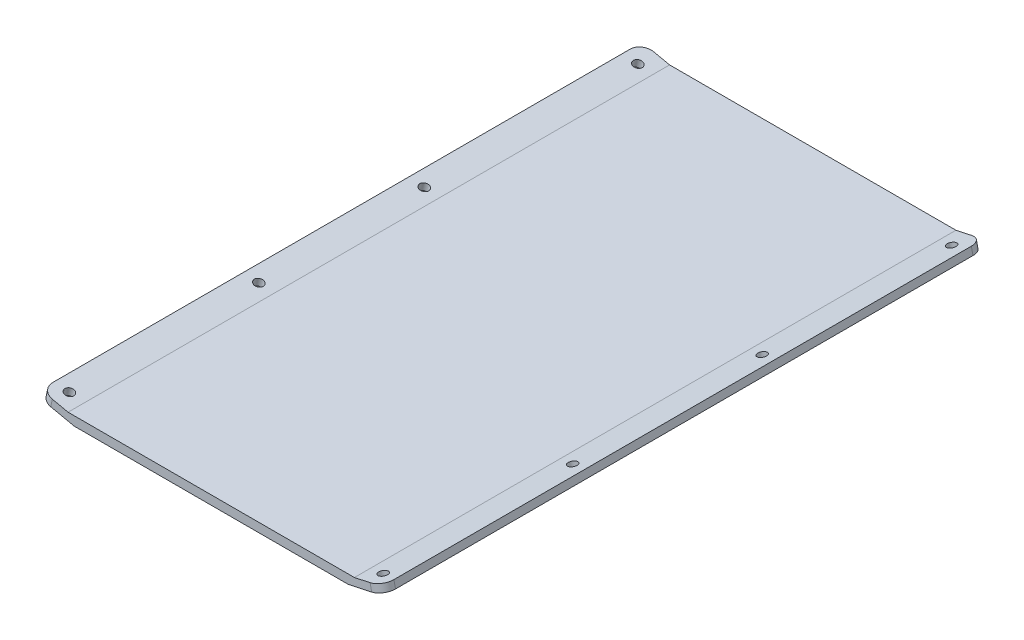
ISO-10303-21;
HEADER;
FILE_DESCRIPTION(('STEP AP214'),'2;1');
FILE_NAME('part.step','',(''),(''),'','','');
FILE_SCHEMA(('AUTOMOTIVE_DESIGN { 1 0 10303 214 1 1 1 1 }'));
ENDSEC;
DATA;
#1=APPLICATION_CONTEXT('core data for automotive mechanical design processes');
#2=APPLICATION_PROTOCOL_DEFINITION('international standard','automotive_design',2000,#1);
#3=PRODUCT_CONTEXT('',#1,'mechanical');
#4=PRODUCT('Part','Part','',(#3));
#5=PRODUCT_RELATED_PRODUCT_CATEGORY('part','',(#4));
#6=PRODUCT_DEFINITION_FORMATION('','',#4);
#7=PRODUCT_DEFINITION_CONTEXT('part definition',#1,'design');
#8=PRODUCT_DEFINITION('design','',#6,#7);
#9=PRODUCT_DEFINITION_SHAPE('','',#8);
#10=(LENGTH_UNIT() NAMED_UNIT(*) SI_UNIT(.MILLI.,.METRE.));
#11=(NAMED_UNIT(*) PLANE_ANGLE_UNIT() SI_UNIT($,.RADIAN.));
#12=(NAMED_UNIT(*) SI_UNIT($,.STERADIAN.) SOLID_ANGLE_UNIT());
#13=UNCERTAINTY_MEASURE_WITH_UNIT(LENGTH_MEASURE(1.E-05),#10,'distance_accuracy_value','');
#14=(GEOMETRIC_REPRESENTATION_CONTEXT(3) GLOBAL_UNCERTAINTY_ASSIGNED_CONTEXT((#13)) GLOBAL_UNIT_ASSIGNED_CONTEXT((#10,
#11,#12)) REPRESENTATION_CONTEXT('',''));
#15=CARTESIAN_POINT('',(0.,0.,0.));
#16=DIRECTION('',(0.,0.,1.));
#17=DIRECTION('',(1.,0.,0.));
#18=AXIS2_PLACEMENT_3D('',#15,#16,#17);
#19=CARTESIAN_POINT('',(149.808156351038,-308.786682776371,209.55));
#20=DIRECTION('',(-0.211002067247362,0.977485615043689,0.));
#21=DIRECTION('',(-0.977485615043689,-0.211002067247362,0.));
#22=AXIS2_PLACEMENT_3D('',#19,#20,#21);
#23=CYLINDRICAL_SURFACE('',#22,2.38125000000007);
#24=CARTESIAN_POINT('',(82.815,1.565,209.55));
#25=DIRECTION('',(-0.211002067247362,0.977485615043689,0.));
#26=DIRECTION('',(-0.977485615043689,-0.211002067247362,0.));
#27=AXIS2_PLACEMENT_3D('',#24,#25,#26);
#28=CIRCLE('',#27,2.38125000000007);
#29=CARTESIAN_POINT('',(80.4873623791772,1.06255132736721,209.55));
#30=VERTEX_POINT('',#29);
#31=EDGE_CURVE('E48',#30,#30,#28,.T.);
#32=ORIENTED_EDGE('',*,*,#31,.T.);
#33=EDGE_LOOP('',(#32));
#34=FACE_BOUND('',#33,.T.);
#35=CARTESIAN_POINT('',(83.6543574892444,-2.32339731439074,209.55));
#36=DIRECTION('',(-0.211002067247362,0.977485615043689,0.));
#37=DIRECTION('',(-0.977485615043689,-0.211002067247362,0.));
#38=AXIS2_PLACEMENT_3D('',#35,#36,#37);
#39=CIRCLE('',#38,2.38125000000007);
#40=CARTESIAN_POINT('',(81.3267198684215,-2.82584598702354,209.55));
#41=VERTEX_POINT('',#40);
#42=EDGE_CURVE('E11',#41,#41,#39,.T.);
#43=ORIENTED_EDGE('',*,*,#42,.F.);
#44=EDGE_LOOP('',(#43));
#45=FACE_BOUND('',#44,.T.);
#46=ADVANCED_FACE('F41',(#34,#45),#23,.F.);
#47=CARTESIAN_POINT('',(-75.565,0.,317.5));
#48=DIRECTION('',(-0.211002067247362,-0.977485615043689,0.));
#49=DIRECTION('',(0.977485615043689,-0.211002067247362,0.));
#50=AXIS2_PLACEMENT_3D('',#47,#48,#49);
#51=PLANE('',#50);
#52=CARTESIAN_POINT('',(-82.815,1.56499999999998,9.525));
#53=DIRECTION('',(0.211002067247362,0.977485615043689,0.));
#54=DIRECTION('',(-0.977485615043689,0.211002067247362,0.));
#55=AXIS2_PLACEMENT_3D('',#52,#53,#54);
#56=CIRCLE('',#55,2.38125000000001);
#57=CARTESIAN_POINT('',(-85.1426376208228,2.06744867263276,9.525));
#58=VERTEX_POINT('',#57);
#59=EDGE_CURVE('E232',#58,#58,#56,.T.);
#60=ORIENTED_EDGE('',*,*,#59,.F.);
#61=EDGE_LOOP('',(#60));
#62=FACE_BOUND('',#61,.T.);
#63=CARTESIAN_POINT('',(-82.815,1.56499999999998,122.2375));
#64=DIRECTION('',(0.211002067247362,0.977485615043689,0.));
#65=DIRECTION('',(-0.977485615043689,0.211002067247362,0.));
#66=AXIS2_PLACEMENT_3D('',#63,#64,#65);
#67=CIRCLE('',#66,2.38125000000001);
#68=CARTESIAN_POINT('',(-85.1426376208228,2.06744867263276,122.2375));
#69=VERTEX_POINT('',#68);
#70=EDGE_CURVE('E314',#69,#69,#67,.T.);
#71=ORIENTED_EDGE('',*,*,#70,.F.);
#72=EDGE_LOOP('',(#71));
#73=FACE_BOUND('',#72,.T.);
#74=CARTESIAN_POINT('',(-82.815,1.56499999999998,209.55));
#75=DIRECTION('',(0.211002067247362,0.977485615043689,0.));
#76=DIRECTION('',(-0.977485615043689,0.211002067247362,0.));
#77=AXIS2_PLACEMENT_3D('',#74,#75,#76);
#78=CIRCLE('',#77,2.38125000000001);
#79=CARTESIAN_POINT('',(-85.1426376208228,2.06744867263276,209.55));
#80=VERTEX_POINT('',#79);
#81=EDGE_CURVE('E310',#80,#80,#78,.T.);
#82=ORIENTED_EDGE('',*,*,#81,.F.);
#83=EDGE_LOOP('',(#82));
#84=FACE_BOUND('',#83,.T.);
#85=CARTESIAN_POINT('',(-82.815,1.56499999999998,309.5625));
#86=DIRECTION('',(0.211002067247362,0.977485615043689,0.));
#87=DIRECTION('',(-0.977485615043689,0.211002067247362,0.));
#88=AXIS2_PLACEMENT_3D('',#85,#86,#87);
#89=CIRCLE('',#88,2.38125000000008);
#90=CARTESIAN_POINT('',(-85.1426376208229,2.06744867263278,309.5625));
#91=VERTEX_POINT('',#90);
#92=EDGE_CURVE('E307',#91,#91,#89,.T.);
#93=ORIENTED_EDGE('',*,*,#92,.F.);
#94=EDGE_LOOP('',(#93));
#95=FACE_BOUND('',#94,.T.);
#96=DIRECTION('',(-0.977485615043689,0.211002067247362,0.));
#97=VECTOR('',#96,1.);
#98=CARTESIAN_POINT('',(-75.565,0.,0.));
#99=LINE('',#98,#97);
#100=CARTESIAN_POINT('',(-75.565,0.,0.));
#101=VERTEX_POINT('',#100);
#102=CARTESIAN_POINT('',(-83.8579663444726,1.79013687297923,0.));
#103=VERTEX_POINT('',#102);
#104=EDGE_CURVE('E167',#101,#103,#99,.T.);
#105=ORIENTED_EDGE('',*,*,#104,.T.);
#106=CARTESIAN_POINT('',(-83.8579663444726,1.79013687297923,6.35000000000002));
#107=DIRECTION('',(-0.211002067247362,-0.977485615043689,0.));
#108=DIRECTION('',(0.977485615043689,-0.211002067247362,0.));
#109=AXIS2_PLACEMENT_3D('',#106,#107,#108);
#110=CIRCLE('',#109,6.35);
#111=CARTESIAN_POINT('',(-90.065,3.12999999999998,6.35000000000013));
#112=VERTEX_POINT('',#111);
#113=EDGE_CURVE('E212',#103,#112,#110,.F.);
#114=ORIENTED_EDGE('',*,*,#113,.T.);
#115=DIRECTION('',(0.,0.,-1.));
#116=VECTOR('',#115,1.);
#117=CARTESIAN_POINT('',(-90.065,3.12999999999998,317.5));
#118=LINE('',#117,#116);
#119=CARTESIAN_POINT('',(-90.065,3.12999999999998,311.15));
#120=VERTEX_POINT('',#119);
#121=EDGE_CURVE('E194',#120,#112,#118,.T.);
#122=ORIENTED_EDGE('',*,*,#121,.F.);
#123=CARTESIAN_POINT('',(-83.8579663444726,1.79013687297923,311.15));
#124=DIRECTION('',(-0.211002067247362,-0.977485615043689,0.));
#125=DIRECTION('',(0.977485615043689,-0.211002067247362,0.));
#126=AXIS2_PLACEMENT_3D('',#123,#124,#125);
#127=CIRCLE('',#126,6.35);
#128=CARTESIAN_POINT('',(-83.8579663444726,1.79013687297923,317.5));
#129=VERTEX_POINT('',#128);
#130=EDGE_CURVE('E210',#120,#129,#127,.F.);
#131=ORIENTED_EDGE('',*,*,#130,.T.);
#132=DIRECTION('',(-0.977485615043689,0.211002067247362,0.));
#133=VECTOR('',#132,1.);
#134=CARTESIAN_POINT('',(-75.565,0.,317.5));
#135=LINE('',#134,#133);
#136=CARTESIAN_POINT('',(-75.565,0.,317.5));
#137=VERTEX_POINT('',#136);
#138=EDGE_CURVE('E142',#137,#129,#135,.T.);
#139=ORIENTED_EDGE('',*,*,#138,.F.);
#140=DIRECTION('',(0.,0.,-1.));
#141=VECTOR('',#140,1.);
#142=CARTESIAN_POINT('',(-75.565,0.,317.5));
#143=LINE('',#142,#141);
#144=EDGE_CURVE('E166',#137,#101,#143,.T.);
#145=ORIENTED_EDGE('',*,*,#144,.T.);
#146=EDGE_LOOP('',(#105,#114,#122,#131,#139,#145));
#147=FACE_BOUND('',#146,.T.);
#148=ADVANCED_FACE('F262',(#62,#73,#84,#95,#147),#51,.F.);
#149=CARTESIAN_POINT('',(-90.065,3.12999999999998,317.5));
#150=DIRECTION('',(0.977485615043689,-0.211002067247362,0.));
#151=DIRECTION('',(0.211002067247362,0.977485615043689,0.));
#152=AXIS2_PLACEMENT_3D('',#149,#150,#151);
#153=PLANE('',#152);
#154=ORIENTED_EDGE('',*,*,#121,.T.);
#155=DIRECTION('',(-0.211002067247362,-0.977485615043689,0.));
#156=VECTOR('',#155,1.);
#157=CARTESIAN_POINT('',(-90.065,3.12999999999998,6.35000000000002));
#158=LINE('',#157,#156);
#159=CARTESIAN_POINT('',(-90.9043574892443,-0.758397314390727,6.35000000000013));
#160=VERTEX_POINT('',#159);
#161=EDGE_CURVE('E199',#112,#160,#158,.T.);
#162=ORIENTED_EDGE('',*,*,#161,.T.);
#163=DIRECTION('',(0.,0.,-1.));
#164=VECTOR('',#163,1.);
#165=CARTESIAN_POINT('',(-90.9043574892443,-0.758397314390727,317.5));
#166=LINE('',#165,#164);
#167=CARTESIAN_POINT('',(-90.9043574892443,-0.758397314390727,311.15));
#168=VERTEX_POINT('',#167);
#169=EDGE_CURVE('E152',#168,#160,#166,.T.);
#170=ORIENTED_EDGE('',*,*,#169,.F.);
#171=DIRECTION('',(-0.211002067247362,-0.977485615043689,0.));
#172=VECTOR('',#171,1.);
#173=CARTESIAN_POINT('',(-90.065,3.12999999999998,311.15));
#174=LINE('',#173,#172);
#175=EDGE_CURVE('E197',#168,#120,#174,.F.);
#176=ORIENTED_EDGE('',*,*,#175,.T.);
#177=EDGE_LOOP('',(#154,#162,#170,#176));
#178=FACE_BOUND('',#177,.T.);
#179=ADVANCED_FACE('F266',(#178),#153,.F.);
#180=CARTESIAN_POINT('',(-90.9043574892443,-0.758397314390727,317.5));
#181=DIRECTION('',(0.211002067247362,0.977485615043689,0.));
#182=DIRECTION('',(-0.977485615043689,0.211002067247362,0.));
#183=AXIS2_PLACEMENT_3D('',#180,#181,#182);
#184=PLANE('',#183);
#185=CARTESIAN_POINT('',(-83.6543574892443,-2.32339731439074,9.525));
#186=DIRECTION('',(0.211002067247362,0.977485615043689,0.));
#187=DIRECTION('',(-0.977485615043689,0.211002067247362,0.));
#188=AXIS2_PLACEMENT_3D('',#185,#186,#187);
#189=CIRCLE('',#188,2.38125000000001);
#190=CARTESIAN_POINT('',(-85.9819951100671,-1.82094864175796,9.525));
#191=VERTEX_POINT('',#190);
#192=EDGE_CURVE('E170',#191,#191,#189,.T.);
#193=ORIENTED_EDGE('',*,*,#192,.T.);
#194=EDGE_LOOP('',(#193));
#195=FACE_BOUND('',#194,.T.);
#196=CARTESIAN_POINT('',(-83.6543574892443,-2.32339731439074,122.2375));
#197=DIRECTION('',(0.211002067247362,0.977485615043689,0.));
#198=DIRECTION('',(-0.977485615043689,0.211002067247362,0.));
#199=AXIS2_PLACEMENT_3D('',#196,#197,#198);
#200=CIRCLE('',#199,2.38125000000001);
#201=CARTESIAN_POINT('',(-85.9819951100671,-1.82094864175796,122.2375));
#202=VERTEX_POINT('',#201);
#203=EDGE_CURVE('E235',#202,#202,#200,.T.);
#204=ORIENTED_EDGE('',*,*,#203,.T.);
#205=EDGE_LOOP('',(#204));
#206=FACE_BOUND('',#205,.T.);
#207=CARTESIAN_POINT('',(-83.6543574892443,-2.32339731439074,209.55));
#208=DIRECTION('',(0.211002067247362,0.977485615043689,0.));
#209=DIRECTION('',(-0.977485615043689,0.211002067247362,0.));
#210=AXIS2_PLACEMENT_3D('',#207,#208,#209);
#211=CIRCLE('',#210,2.38125000000001);
#212=CARTESIAN_POINT('',(-85.9819951100671,-1.82094864175796,209.55));
#213=VERTEX_POINT('',#212);
#214=EDGE_CURVE('E231',#213,#213,#211,.T.);
#215=ORIENTED_EDGE('',*,*,#214,.T.);
#216=EDGE_LOOP('',(#215));
#217=FACE_BOUND('',#216,.T.);
#218=CARTESIAN_POINT('',(-83.6543574892443,-2.32339731439074,309.5625));
#219=DIRECTION('',(0.211002067247362,0.977485615043689,0.));
#220=DIRECTION('',(-0.977485615043689,0.211002067247362,0.));
#221=AXIS2_PLACEMENT_3D('',#218,#219,#220);
#222=CIRCLE('',#221,2.38125000000008);
#223=CARTESIAN_POINT('',(-85.9819951100672,-1.82094864175794,309.5625));
#224=VERTEX_POINT('',#223);
#225=EDGE_CURVE('E228',#224,#224,#222,.T.);
#226=ORIENTED_EDGE('',*,*,#225,.T.);
#227=EDGE_LOOP('',(#226));
#228=FACE_BOUND('',#227,.T.);
#229=ORIENTED_EDGE('',*,*,#169,.T.);
#230=CARTESIAN_POINT('',(-84.6973238337169,-2.09826044141147,6.35000000000002));
#231=DIRECTION('',(0.211002067247362,0.977485615043689,0.));
#232=DIRECTION('',(-0.977485615043689,0.211002067247362,0.));
#233=AXIS2_PLACEMENT_3D('',#230,#231,#232);
#234=CIRCLE('',#233,6.35);
#235=CARTESIAN_POINT('',(-84.6973238337169,-2.09826044141147,0.));
#236=VERTEX_POINT('',#235);
#237=EDGE_CURVE('E204',#160,#236,#234,.F.);
#238=ORIENTED_EDGE('',*,*,#237,.T.);
#239=DIRECTION('',(0.977485615043689,-0.211002067247362,0.));
#240=VECTOR('',#239,1.);
#241=CARTESIAN_POINT('',(-90.9043574892443,-0.758397314390727,0.));
#242=LINE('',#241,#240);
#243=CARTESIAN_POINT('',(-72.355,-4.76250000000002,0.));
#244=VERTEX_POINT('',#243);
#245=EDGE_CURVE('E149',#236,#244,#242,.T.);
#246=ORIENTED_EDGE('',*,*,#245,.T.);
#247=DIRECTION('',(0.,0.,-1.));
#248=VECTOR('',#247,1.);
#249=CARTESIAN_POINT('',(-72.355,-4.76250000000002,317.5));
#250=LINE('',#249,#248);
#251=CARTESIAN_POINT('',(-72.355,-4.76250000000002,317.5));
#252=VERTEX_POINT('',#251);
#253=EDGE_CURVE('E145',#252,#244,#250,.T.);
#254=ORIENTED_EDGE('',*,*,#253,.F.);
#255=DIRECTION('',(0.977485615043689,-0.211002067247362,0.));
#256=VECTOR('',#255,1.);
#257=CARTESIAN_POINT('',(-90.9043574892443,-0.758397314390727,317.5));
#258=LINE('',#257,#256);
#259=CARTESIAN_POINT('',(-84.6973238337169,-2.09826044141147,317.5));
#260=VERTEX_POINT('',#259);
#261=EDGE_CURVE('E132',#260,#252,#258,.T.);
#262=ORIENTED_EDGE('',*,*,#261,.F.);
#263=CARTESIAN_POINT('',(-84.6973238337169,-2.09826044141147,311.15));
#264=DIRECTION('',(0.211002067247362,0.977485615043689,0.));
#265=DIRECTION('',(-0.977485615043689,0.211002067247362,0.));
#266=AXIS2_PLACEMENT_3D('',#263,#264,#265);
#267=CIRCLE('',#266,6.35);
#268=EDGE_CURVE('E202',#260,#168,#267,.F.);
#269=ORIENTED_EDGE('',*,*,#268,.T.);
#270=EDGE_LOOP('',(#229,#238,#246,#254,#262,#269));
#271=FACE_BOUND('',#270,.T.);
#272=ADVANCED_FACE('F147',(#195,#206,#217,#228,#271),#184,.F.);
#273=CARTESIAN_POINT('',(-72.355,-4.76250000000002,317.5));
#274=DIRECTION('',(0.,1.,0.));
#275=DIRECTION('',(-1.,0.,0.));
#276=AXIS2_PLACEMENT_3D('',#273,#274,#275);
#277=PLANE('',#276);
#278=DIRECTION('',(1.,0.,0.));
#279=VECTOR('',#278,1.);
#280=CARTESIAN_POINT('',(-72.355,-4.76250000000002,0.));
#281=LINE('',#280,#279);
#282=CARTESIAN_POINT('',(72.355,-4.7625,0.));
#283=VERTEX_POINT('',#282);
#284=EDGE_CURVE('E172',#244,#283,#281,.T.);
#285=ORIENTED_EDGE('',*,*,#284,.T.);
#286=DIRECTION('',(0.,0.,-1.));
#287=VECTOR('',#286,1.);
#288=CARTESIAN_POINT('',(72.355,-4.7625,317.5));
#289=LINE('',#288,#287);
#290=CARTESIAN_POINT('',(72.355,-4.7625,317.5));
#291=VERTEX_POINT('',#290);
#292=EDGE_CURVE('E153',#291,#283,#289,.T.);
#293=ORIENTED_EDGE('',*,*,#292,.F.);
#294=DIRECTION('',(1.,0.,0.));
#295=VECTOR('',#294,1.);
#296=CARTESIAN_POINT('',(-72.355,-4.76250000000002,317.5));
#297=LINE('',#296,#295);
#298=EDGE_CURVE('E136',#252,#291,#297,.T.);
#299=ORIENTED_EDGE('',*,*,#298,.F.);
#300=ORIENTED_EDGE('',*,*,#253,.T.);
#301=EDGE_LOOP('',(#285,#293,#299,#300));
#302=FACE_BOUND('',#301,.T.);
#303=ADVANCED_FACE('F155',(#302),#277,.F.);
#304=CARTESIAN_POINT('',(90.9043574892443,-0.7583973143907,317.5));
#305=DIRECTION('',(-0.211002067247362,0.977485615043689,0.));
#306=DIRECTION('',(-0.977485615043689,-0.211002067247362,0.));
#307=AXIS2_PLACEMENT_3D('',#304,#305,#306);
#308=PLANE('',#307);
#309=CARTESIAN_POINT('',(83.6543574892444,-2.32339731439074,309.5625));
#310=DIRECTION('',(-0.211002067247362,0.977485615043689,0.));
#311=DIRECTION('',(-0.977485615043689,-0.211002067247362,0.));
#312=AXIS2_PLACEMENT_3D('',#309,#310,#311);
#313=CIRCLE('',#312,2.38125000000007);
#314=CARTESIAN_POINT('',(81.3267198684215,-2.82584598702354,309.5625));
#315=VERTEX_POINT('',#314);
#316=EDGE_CURVE('E330',#315,#315,#313,.T.);
#317=ORIENTED_EDGE('',*,*,#316,.T.);
#318=EDGE_LOOP('',(#317));
#319=FACE_BOUND('',#318,.T.);
#320=CARTESIAN_POINT('',(83.6543574892444,-2.32339731439074,109.5375));
#321=DIRECTION('',(-0.211002067247362,0.977485615043689,0.));
#322=DIRECTION('',(-0.977485615043689,-0.211002067247362,0.));
#323=AXIS2_PLACEMENT_3D('',#320,#321,#322);
#324=CIRCLE('',#323,2.38125000000007);
#325=CARTESIAN_POINT('',(81.3267198684215,-2.82584598702354,109.5375));
#326=VERTEX_POINT('',#325);
#327=EDGE_CURVE('E324',#326,#326,#324,.T.);
#328=ORIENTED_EDGE('',*,*,#327,.T.);
#329=EDGE_LOOP('',(#328));
#330=FACE_BOUND('',#329,.T.);
#331=CARTESIAN_POINT('',(83.6543574892444,-2.32339731439074,9.525));
#332=DIRECTION('',(-0.211002067247362,0.977485615043689,0.));
#333=DIRECTION('',(-0.977485615043689,-0.211002067247362,0.));
#334=AXIS2_PLACEMENT_3D('',#331,#332,#333);
#335=CIRCLE('',#334,2.38125000000007);
#336=CARTESIAN_POINT('',(81.3267198684215,-2.82584598702354,9.525));
#337=VERTEX_POINT('',#336);
#338=EDGE_CURVE('E311',#337,#337,#335,.T.);
#339=ORIENTED_EDGE('',*,*,#338,.T.);
#340=EDGE_LOOP('',(#339));
#341=FACE_BOUND('',#340,.T.);
#342=DIRECTION('',(0.977485615043689,0.211002067247362,0.));
#343=VECTOR('',#342,1.);
#344=CARTESIAN_POINT('',(90.9043574892443,-0.7583973143907,0.));
#345=LINE('',#344,#343);
#346=CARTESIAN_POINT('',(84.6973238337169,-2.09826044141145,0.));
#347=VERTEX_POINT('',#346);
#348=EDGE_CURVE('E174',#283,#347,#345,.T.);
#349=ORIENTED_EDGE('',*,*,#348,.T.);
#350=CARTESIAN_POINT('',(84.6973238337169,-2.09826044141145,6.35000000000002));
#351=DIRECTION('',(-0.211002067247362,0.977485615043689,0.));
#352=DIRECTION('',(-0.977485615043689,-0.211002067247362,0.));
#353=AXIS2_PLACEMENT_3D('',#350,#351,#352);
#354=CIRCLE('',#353,6.35);
#355=CARTESIAN_POINT('',(90.9043574892443,-0.7583973143907,6.35000000000013));
#356=VERTEX_POINT('',#355);
#357=EDGE_CURVE('E223',#347,#356,#354,.F.);
#358=ORIENTED_EDGE('',*,*,#357,.T.);
#359=DIRECTION('',(0.,0.,-1.));
#360=VECTOR('',#359,1.);
#361=CARTESIAN_POINT('',(90.9043574892443,-0.7583973143907,317.5));
#362=LINE('',#361,#360);
#363=CARTESIAN_POINT('',(90.9043574892443,-0.7583973143907,311.15));
#364=VERTEX_POINT('',#363);
#365=EDGE_CURVE('E189',#364,#356,#362,.T.);
#366=ORIENTED_EDGE('',*,*,#365,.F.);
#367=CARTESIAN_POINT('',(84.6973238337169,-2.09826044141145,311.15));
#368=DIRECTION('',(-0.211002067247362,0.977485615043689,0.));
#369=DIRECTION('',(-0.977485615043689,-0.211002067247362,0.));
#370=AXIS2_PLACEMENT_3D('',#367,#368,#369);
#371=CIRCLE('',#370,6.35);
#372=CARTESIAN_POINT('',(84.6973238337169,-2.09826044141145,317.5));
#373=VERTEX_POINT('',#372);
#374=EDGE_CURVE('E55',#364,#373,#371,.F.);
#375=ORIENTED_EDGE('',*,*,#374,.T.);
#376=DIRECTION('',(0.977485615043689,0.211002067247362,0.));
#377=VECTOR('',#376,1.);
#378=CARTESIAN_POINT('',(90.9043574892443,-0.7583973143907,317.5));
#379=LINE('',#378,#377);
#380=EDGE_CURVE('E157',#291,#373,#379,.T.);
#381=ORIENTED_EDGE('',*,*,#380,.F.);
#382=ORIENTED_EDGE('',*,*,#292,.T.);
#383=EDGE_LOOP('',(#349,#358,#366,#375,#381,#382));
#384=FACE_BOUND('',#383,.T.);
#385=ORIENTED_EDGE('',*,*,#42,.T.);
#386=EDGE_LOOP('',(#385));
#387=FACE_BOUND('',#386,.T.);
#388=ADVANCED_FACE('F256',(#319,#330,#341,#384,#387),#308,.F.);
#389=CARTESIAN_POINT('',(90.065,3.13,317.5));
#390=DIRECTION('',(-0.977485615043689,-0.211002067247365,0.));
#391=DIRECTION('',(0.211002067247365,-0.977485615043689,0.));
#392=AXIS2_PLACEMENT_3D('',#389,#390,#391);
#393=PLANE('',#392);
#394=ORIENTED_EDGE('',*,*,#365,.T.);
#395=DIRECTION('',(-0.211002067247365,0.977485615043689,0.));
#396=VECTOR('',#395,1.);
#397=CARTESIAN_POINT('',(90.065,3.13,6.35000000000002));
#398=LINE('',#397,#396);
#399=CARTESIAN_POINT('',(90.065,3.13,6.35000000000013));
#400=VERTEX_POINT('',#399);
#401=EDGE_CURVE('E216',#356,#400,#398,.T.);
#402=ORIENTED_EDGE('',*,*,#401,.T.);
#403=DIRECTION('',(0.,0.,-1.));
#404=VECTOR('',#403,1.);
#405=CARTESIAN_POINT('',(90.065,3.13,317.5));
#406=LINE('',#405,#404);
#407=CARTESIAN_POINT('',(90.065,3.13,311.15));
#408=VERTEX_POINT('',#407);
#409=EDGE_CURVE('E186',#408,#400,#406,.T.);
#410=ORIENTED_EDGE('',*,*,#409,.F.);
#411=DIRECTION('',(-0.211002067247365,0.977485615043689,0.));
#412=VECTOR('',#411,1.);
#413=CARTESIAN_POINT('',(90.9043574892443,-0.758397314390707,311.15));
#414=LINE('',#413,#412);
#415=EDGE_CURVE('E214',#408,#364,#414,.F.);
#416=ORIENTED_EDGE('',*,*,#415,.T.);
#417=EDGE_LOOP('',(#394,#402,#410,#416));
#418=FACE_BOUND('',#417,.T.);
#419=ADVANCED_FACE('F247',(#418),#393,.F.);
#420=CARTESIAN_POINT('',(75.565,0.,317.5));
#421=DIRECTION('',(0.211002067247362,-0.977485615043689,0.));
#422=DIRECTION('',(0.977485615043689,0.211002067247362,0.));
#423=AXIS2_PLACEMENT_3D('',#420,#421,#422);
#424=PLANE('',#423);
#425=CARTESIAN_POINT('',(82.815,1.565,309.5625));
#426=DIRECTION('',(-0.211002067247362,0.977485615043689,0.));
#427=DIRECTION('',(-0.977485615043689,-0.211002067247362,0.));
#428=AXIS2_PLACEMENT_3D('',#425,#426,#427);
#429=CIRCLE('',#428,2.38125000000007);
#430=CARTESIAN_POINT('',(80.4873623791772,1.06255132736721,309.5625));
#431=VERTEX_POINT('',#430);
#432=EDGE_CURVE('E333',#431,#431,#429,.T.);
#433=ORIENTED_EDGE('',*,*,#432,.F.);
#434=EDGE_LOOP('',(#433));
#435=FACE_BOUND('',#434,.T.);
#436=CARTESIAN_POINT('',(82.815,1.565,109.5375));
#437=DIRECTION('',(-0.211002067247362,0.977485615043689,0.));
#438=DIRECTION('',(-0.977485615043689,-0.211002067247362,0.));
#439=AXIS2_PLACEMENT_3D('',#436,#437,#438);
#440=CIRCLE('',#439,2.38125000000007);
#441=CARTESIAN_POINT('',(80.4873623791772,1.06255132736721,109.5375));
#442=VERTEX_POINT('',#441);
#443=EDGE_CURVE('E327',#442,#442,#440,.T.);
#444=ORIENTED_EDGE('',*,*,#443,.F.);
#445=EDGE_LOOP('',(#444));
#446=FACE_BOUND('',#445,.T.);
#447=CARTESIAN_POINT('',(82.815,1.565,9.525));
#448=DIRECTION('',(-0.211002067247362,0.977485615043689,0.));
#449=DIRECTION('',(-0.977485615043689,-0.211002067247362,0.));
#450=AXIS2_PLACEMENT_3D('',#447,#448,#449);
#451=CIRCLE('',#450,2.38125000000007);
#452=CARTESIAN_POINT('',(80.4873623791772,1.06255132736721,9.525));
#453=VERTEX_POINT('',#452);
#454=EDGE_CURVE('E321',#453,#453,#451,.T.);
#455=ORIENTED_EDGE('',*,*,#454,.F.);
#456=EDGE_LOOP('',(#455));
#457=FACE_BOUND('',#456,.T.);
#458=ORIENTED_EDGE('',*,*,#409,.T.);
#459=CARTESIAN_POINT('',(83.8579663444726,1.79013687297925,6.35000000000002));
#460=DIRECTION('',(0.211002067247362,-0.977485615043689,0.));
#461=DIRECTION('',(0.977485615043689,0.211002067247362,0.));
#462=AXIS2_PLACEMENT_3D('',#459,#460,#461);
#463=CIRCLE('',#462,6.35);
#464=CARTESIAN_POINT('',(83.8579663444726,1.79013687297925,0.));
#465=VERTEX_POINT('',#464);
#466=EDGE_CURVE('E220',#400,#465,#463,.F.);
#467=ORIENTED_EDGE('',*,*,#466,.T.);
#468=DIRECTION('',(-0.977485615043689,-0.211002067247362,0.));
#469=VECTOR('',#468,1.);
#470=CARTESIAN_POINT('',(75.565,0.,0.));
#471=LINE('',#470,#469);
#472=CARTESIAN_POINT('',(75.565,0.,0.));
#473=VERTEX_POINT('',#472);
#474=EDGE_CURVE('E177',#465,#473,#471,.T.);
#475=ORIENTED_EDGE('',*,*,#474,.T.);
#476=DIRECTION('',(0.,0.,-1.));
#477=VECTOR('',#476,1.);
#478=CARTESIAN_POINT('',(75.565,0.,317.5));
#479=LINE('',#478,#477);
#480=CARTESIAN_POINT('',(75.565,0.,317.5));
#481=VERTEX_POINT('',#480);
#482=EDGE_CURVE('E183',#481,#473,#479,.T.);
#483=ORIENTED_EDGE('',*,*,#482,.F.);
#484=DIRECTION('',(-0.977485615043689,-0.211002067247362,0.));
#485=VECTOR('',#484,1.);
#486=CARTESIAN_POINT('',(75.565,0.,317.5));
#487=LINE('',#486,#485);
#488=CARTESIAN_POINT('',(83.8579663444726,1.79013687297925,317.5));
#489=VERTEX_POINT('',#488);
#490=EDGE_CURVE('E159',#489,#481,#487,.T.);
#491=ORIENTED_EDGE('',*,*,#490,.F.);
#492=CARTESIAN_POINT('',(83.8579663444726,1.79013687297925,311.15));
#493=DIRECTION('',(0.211002067247362,-0.977485615043689,0.));
#494=DIRECTION('',(0.977485615043689,0.211002067247362,0.));
#495=AXIS2_PLACEMENT_3D('',#492,#493,#494);
#496=CIRCLE('',#495,6.35);
#497=EDGE_CURVE('E63',#489,#408,#496,.F.);
#498=ORIENTED_EDGE('',*,*,#497,.T.);
#499=EDGE_LOOP('',(#458,#467,#475,#483,#491,#498));
#500=FACE_BOUND('',#499,.T.);
#501=ORIENTED_EDGE('',*,*,#31,.F.);
#502=EDGE_LOOP('',(#501));
#503=FACE_BOUND('',#502,.T.);
#504=ADVANCED_FACE('F244',(#435,#446,#457,#500,#503),#424,.F.);
#505=CARTESIAN_POINT('',(75.565,0.,317.5));
#506=DIRECTION('',(0.,-1.,0.));
#507=DIRECTION('',(1.,0.,0.));
#508=AXIS2_PLACEMENT_3D('',#505,#506,#507);
#509=PLANE('',#508);
#510=DIRECTION('',(-1.,0.,0.));
#511=VECTOR('',#510,1.);
#512=CARTESIAN_POINT('',(75.565,0.,0.));
#513=LINE('',#512,#511);
#514=EDGE_CURVE('E179',#473,#101,#513,.T.);
#515=ORIENTED_EDGE('',*,*,#514,.T.);
#516=ORIENTED_EDGE('',*,*,#144,.F.);
#517=DIRECTION('',(-1.,0.,0.));
#518=VECTOR('',#517,1.);
#519=CARTESIAN_POINT('',(75.565,0.,317.5));
#520=LINE('',#519,#518);
#521=EDGE_CURVE('E164',#481,#137,#520,.T.);
#522=ORIENTED_EDGE('',*,*,#521,.F.);
#523=ORIENTED_EDGE('',*,*,#482,.T.);
#524=EDGE_LOOP('',(#515,#516,#522,#523));
#525=FACE_BOUND('',#524,.T.);
#526=ADVANCED_FACE('F246',(#525),#509,.F.);
#527=CARTESIAN_POINT('',(0.,0.,317.5));
#528=DIRECTION('',(0.,0.,1.));
#529=DIRECTION('',(1.,0.,0.));
#530=AXIS2_PLACEMENT_3D('',#527,#528,#529);
#531=PLANE('',#530);
#532=ORIENTED_EDGE('',*,*,#380,.T.);
#533=DIRECTION('',(-0.211002067247365,0.977485615043689,0.));
#534=VECTOR('',#533,1.);
#535=CARTESIAN_POINT('',(83.8579663444726,1.79013687297923,317.5));
#536=LINE('',#535,#534);
#537=EDGE_CURVE('E226',#373,#489,#536,.T.);
#538=ORIENTED_EDGE('',*,*,#537,.T.);
#539=ORIENTED_EDGE('',*,*,#490,.T.);
#540=ORIENTED_EDGE('',*,*,#521,.T.);
#541=ORIENTED_EDGE('',*,*,#138,.T.);
#542=DIRECTION('',(-0.211002067247362,-0.977485615043689,0.));
#543=VECTOR('',#542,1.);
#544=CARTESIAN_POINT('',(-84.6973238337169,-2.09826044141148,317.5));
#545=LINE('',#544,#543);
#546=EDGE_CURVE('E140',#129,#260,#545,.T.);
#547=ORIENTED_EDGE('',*,*,#546,.T.);
#548=ORIENTED_EDGE('',*,*,#261,.T.);
#549=ORIENTED_EDGE('',*,*,#298,.T.);
#550=EDGE_LOOP('',(#532,#538,#539,#540,#541,#547,#548,#549));
#551=FACE_BOUND('',#550,.T.);
#552=ADVANCED_FACE('F134',(#551),#531,.T.);
#553=CARTESIAN_POINT('',(0.,0.,0.));
#554=DIRECTION('',(0.,0.,1.));
#555=DIRECTION('',(1.,0.,0.));
#556=AXIS2_PLACEMENT_3D('',#553,#554,#555);
#557=PLANE('',#556);
#558=ORIENTED_EDGE('',*,*,#245,.F.);
#559=DIRECTION('',(-0.211002067247362,-0.977485615043689,0.));
#560=VECTOR('',#559,1.);
#561=CARTESIAN_POINT('',(-80.4936710578768,17.3755303731831,0.));
#562=LINE('',#561,#560);
#563=EDGE_CURVE('E208',#236,#103,#562,.F.);
#564=ORIENTED_EDGE('',*,*,#563,.T.);
#565=ORIENTED_EDGE('',*,*,#104,.F.);
#566=ORIENTED_EDGE('',*,*,#514,.F.);
#567=ORIENTED_EDGE('',*,*,#474,.F.);
#568=DIRECTION('',(-0.211002067247365,0.977485615043689,0.));
#569=VECTOR('',#568,1.);
#570=CARTESIAN_POINT('',(80.4936710578767,17.3755303731833,0.));
#571=LINE('',#570,#569);
#572=EDGE_CURVE('E206',#465,#347,#571,.F.);
#573=ORIENTED_EDGE('',*,*,#572,.T.);
#574=ORIENTED_EDGE('',*,*,#348,.F.);
#575=ORIENTED_EDGE('',*,*,#284,.F.);
#576=EDGE_LOOP('',(#558,#564,#565,#566,#567,#573,#574,#575));
#577=FACE_BOUND('',#576,.T.);
#578=ADVANCED_FACE('F282',(#577),#557,.F.);
#579=CARTESIAN_POINT('',(-83.8579663444726,1.79013687297923,6.35000000000002));
#580=DIRECTION('',(-0.211002067247362,-0.977485615043689,0.));
#581=DIRECTION('',(0.977485615043689,-0.211002067247362,0.));
#582=AXIS2_PLACEMENT_3D('',#579,#580,#581);
#583=CYLINDRICAL_SURFACE('',#582,6.35);
#584=ORIENTED_EDGE('',*,*,#113,.F.);
#585=ORIENTED_EDGE('',*,*,#563,.F.);
#586=ORIENTED_EDGE('',*,*,#237,.F.);
#587=ORIENTED_EDGE('',*,*,#161,.F.);
#588=EDGE_LOOP('',(#584,#585,#586,#587));
#589=FACE_BOUND('',#588,.T.);
#590=ADVANCED_FACE('F278',(#589),#583,.T.);
#591=CARTESIAN_POINT('',(83.8579663444726,1.79013687297923,6.35000000000002));
#592=DIRECTION('',(-0.211002067247365,0.977485615043689,0.));
#593=DIRECTION('',(-0.977485615043689,-0.211002067247365,0.));
#594=AXIS2_PLACEMENT_3D('',#591,#592,#593);
#595=CYLINDRICAL_SURFACE('',#594,6.35);
#596=ORIENTED_EDGE('',*,*,#357,.F.);
#597=ORIENTED_EDGE('',*,*,#572,.F.);
#598=ORIENTED_EDGE('',*,*,#466,.F.);
#599=ORIENTED_EDGE('',*,*,#401,.F.);
#600=EDGE_LOOP('',(#596,#597,#598,#599));
#601=FACE_BOUND('',#600,.T.);
#602=ADVANCED_FACE('F281',(#601),#595,.T.);
#603=CARTESIAN_POINT('',(80.4936710578767,17.3755303731833,311.15));
#604=DIRECTION('',(0.211002067247365,-0.977485615043689,0.));
#605=DIRECTION('',(0.977485615043689,0.211002067247365,0.));
#606=AXIS2_PLACEMENT_3D('',#603,#604,#605);
#607=CYLINDRICAL_SURFACE('',#606,6.35);
#608=ORIENTED_EDGE('',*,*,#374,.F.);
#609=ORIENTED_EDGE('',*,*,#415,.F.);
#610=ORIENTED_EDGE('',*,*,#497,.F.);
#611=ORIENTED_EDGE('',*,*,#537,.F.);
#612=EDGE_LOOP('',(#608,#609,#610,#611));
#613=FACE_BOUND('',#612,.T.);
#614=ADVANCED_FACE('F286',(#613),#607,.T.);
#615=CARTESIAN_POINT('',(-80.4936710578768,17.3755303731831,311.15));
#616=DIRECTION('',(0.211002067247362,0.977485615043689,0.));
#617=DIRECTION('',(-0.977485615043689,0.211002067247362,0.));
#618=AXIS2_PLACEMENT_3D('',#615,#616,#617);
#619=CYLINDRICAL_SURFACE('',#618,6.35);
#620=ORIENTED_EDGE('',*,*,#130,.F.);
#621=ORIENTED_EDGE('',*,*,#175,.F.);
#622=ORIENTED_EDGE('',*,*,#268,.F.);
#623=ORIENTED_EDGE('',*,*,#546,.F.);
#624=EDGE_LOOP('',(#620,#621,#622,#623));
#625=FACE_BOUND('',#624,.T.);
#626=ADVANCED_FACE('F289',(#625),#619,.T.);
#627=CARTESIAN_POINT('',(-149.808156351037,-308.786682776371,309.5625));
#628=DIRECTION('',(0.211002067247362,0.977485615043689,0.));
#629=DIRECTION('',(-0.97748561504369,0.211002067247362,0.));
#630=AXIS2_PLACEMENT_3D('',#627,#628,#629);
#631=CYLINDRICAL_SURFACE('',#630,2.38125000000008);
#632=ORIENTED_EDGE('',*,*,#92,.T.);
#633=EDGE_LOOP('',(#632));
#634=FACE_BOUND('',#633,.T.);
#635=ORIENTED_EDGE('',*,*,#225,.F.);
#636=EDGE_LOOP('',(#635));
#637=FACE_BOUND('',#636,.T.);
#638=ADVANCED_FACE('F291',(#634,#637),#631,.F.);
#639=CARTESIAN_POINT('',(-149.808156351037,-308.786682776371,209.55));
#640=DIRECTION('',(0.211002067247362,0.977485615043689,0.));
#641=DIRECTION('',(-0.97748561504369,0.211002067247362,0.));
#642=AXIS2_PLACEMENT_3D('',#639,#640,#641);
#643=CYLINDRICAL_SURFACE('',#642,2.38125000000001);
#644=ORIENTED_EDGE('',*,*,#81,.T.);
#645=EDGE_LOOP('',(#644));
#646=FACE_BOUND('',#645,.T.);
#647=ORIENTED_EDGE('',*,*,#214,.F.);
#648=EDGE_LOOP('',(#647));
#649=FACE_BOUND('',#648,.T.);
#650=ADVANCED_FACE('F296',(#646,#649),#643,.F.);
#651=CARTESIAN_POINT('',(-149.808156351037,-308.786682776371,122.2375));
#652=DIRECTION('',(0.211002067247362,0.977485615043689,0.));
#653=DIRECTION('',(-0.97748561504369,0.211002067247362,0.));
#654=AXIS2_PLACEMENT_3D('',#651,#652,#653);
#655=CYLINDRICAL_SURFACE('',#654,2.38125000000001);
#656=ORIENTED_EDGE('',*,*,#70,.T.);
#657=EDGE_LOOP('',(#656));
#658=FACE_BOUND('',#657,.T.);
#659=ORIENTED_EDGE('',*,*,#203,.F.);
#660=EDGE_LOOP('',(#659));
#661=FACE_BOUND('',#660,.T.);
#662=ADVANCED_FACE('F376',(#658,#661),#655,.F.);
#663=CARTESIAN_POINT('',(-149.808156351037,-308.786682776371,9.525));
#664=DIRECTION('',(0.211002067247362,0.977485615043689,0.));
#665=DIRECTION('',(-0.97748561504369,0.211002067247362,0.));
#666=AXIS2_PLACEMENT_3D('',#663,#664,#665);
#667=CYLINDRICAL_SURFACE('',#666,2.38125000000001);
#668=ORIENTED_EDGE('',*,*,#59,.T.);
#669=EDGE_LOOP('',(#668));
#670=FACE_BOUND('',#669,.T.);
#671=ORIENTED_EDGE('',*,*,#192,.F.);
#672=EDGE_LOOP('',(#671));
#673=FACE_BOUND('',#672,.T.);
#674=ADVANCED_FACE('F380',(#670,#673),#667,.F.);
#675=CARTESIAN_POINT('',(149.808156351038,-308.786682776371,9.525));
#676=DIRECTION('',(-0.211002067247362,0.977485615043689,0.));
#677=DIRECTION('',(-0.977485615043689,-0.211002067247362,0.));
#678=AXIS2_PLACEMENT_3D('',#675,#676,#677);
#679=CYLINDRICAL_SURFACE('',#678,2.38125000000007);
#680=ORIENTED_EDGE('',*,*,#454,.T.);
#681=EDGE_LOOP('',(#680));
#682=FACE_BOUND('',#681,.T.);
#683=ORIENTED_EDGE('',*,*,#338,.F.);
#684=EDGE_LOOP('',(#683));
#685=FACE_BOUND('',#684,.T.);
#686=ADVANCED_FACE('F384',(#682,#685),#679,.F.);
#687=CARTESIAN_POINT('',(149.808156351038,-308.786682776371,109.5375));
#688=DIRECTION('',(-0.211002067247362,0.977485615043689,0.));
#689=DIRECTION('',(-0.977485615043689,-0.211002067247362,0.));
#690=AXIS2_PLACEMENT_3D('',#687,#688,#689);
#691=CYLINDRICAL_SURFACE('',#690,2.38125000000007);
#692=ORIENTED_EDGE('',*,*,#443,.T.);
#693=EDGE_LOOP('',(#692));
#694=FACE_BOUND('',#693,.T.);
#695=ORIENTED_EDGE('',*,*,#327,.F.);
#696=EDGE_LOOP('',(#695));
#697=FACE_BOUND('',#696,.T.);
#698=ADVANCED_FACE('F339',(#694,#697),#691,.F.);
#699=CARTESIAN_POINT('',(149.808156351038,-308.786682776371,309.5625));
#700=DIRECTION('',(-0.211002067247362,0.977485615043689,0.));
#701=DIRECTION('',(-0.977485615043689,-0.211002067247362,0.));
#702=AXIS2_PLACEMENT_3D('',#699,#700,#701);
#703=CYLINDRICAL_SURFACE('',#702,2.38125000000007);
#704=ORIENTED_EDGE('',*,*,#432,.T.);
#705=EDGE_LOOP('',(#704));
#706=FACE_BOUND('',#705,.T.);
#707=ORIENTED_EDGE('',*,*,#316,.F.);
#708=EDGE_LOOP('',(#707));
#709=FACE_BOUND('',#708,.T.);
#710=ADVANCED_FACE('F336',(#706,#709),#703,.F.);
#711=CLOSED_SHELL('',(#46,#148,#179,#272,#303,#388,#419,#504,#526,#552,#578,#590,#602,#614,#626,
#638,#650,#662,#674,#686,#698,#710));
#712=MANIFOLD_SOLID_BREP('B2',#711);
#713=ADVANCED_BREP_SHAPE_REPRESENTATION('',(#18,#712),#14);
#714=SHAPE_DEFINITION_REPRESENTATION(#9,#713);
ENDSEC;
END-ISO-10303-21;
